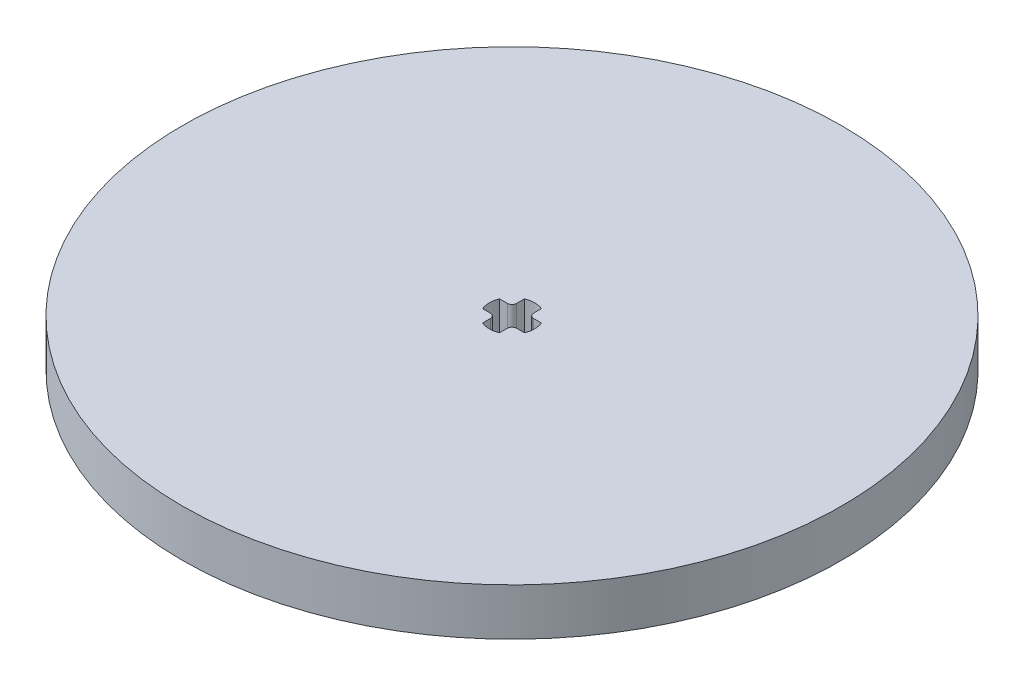
ISO-10303-21;
HEADER;
FILE_DESCRIPTION(('STEP AP214'),'2;1');
FILE_NAME('part.step','',(''),(''),'','','');
FILE_SCHEMA(('AUTOMOTIVE_DESIGN { 1 0 10303 214 1 1 1 1 }'));
ENDSEC;
DATA;
#1=APPLICATION_CONTEXT('core data for automotive mechanical design processes');
#2=APPLICATION_PROTOCOL_DEFINITION('international standard','automotive_design',2000,#1);
#3=PRODUCT_CONTEXT('',#1,'mechanical');
#4=PRODUCT('Part','Part','',(#3));
#5=PRODUCT_RELATED_PRODUCT_CATEGORY('part','',(#4));
#6=PRODUCT_DEFINITION_FORMATION('','',#4);
#7=PRODUCT_DEFINITION_CONTEXT('part definition',#1,'design');
#8=PRODUCT_DEFINITION('design','',#6,#7);
#9=PRODUCT_DEFINITION_SHAPE('','',#8);
#10=(LENGTH_UNIT() NAMED_UNIT(*) SI_UNIT(.MILLI.,.METRE.));
#11=(NAMED_UNIT(*) PLANE_ANGLE_UNIT() SI_UNIT($,.RADIAN.));
#12=(NAMED_UNIT(*) SI_UNIT($,.STERADIAN.) SOLID_ANGLE_UNIT());
#13=UNCERTAINTY_MEASURE_WITH_UNIT(LENGTH_MEASURE(1.E-05),#10,'distance_accuracy_value','');
#14=(GEOMETRIC_REPRESENTATION_CONTEXT(3) GLOBAL_UNCERTAINTY_ASSIGNED_CONTEXT((#13)) GLOBAL_UNIT_ASSIGNED_CONTEXT((#10,
#11,#12)) REPRESENTATION_CONTEXT('',''));
#15=CARTESIAN_POINT('',(0.,0.,0.));
#16=DIRECTION('',(0.,0.,1.));
#17=DIRECTION('',(1.,0.,0.));
#18=AXIS2_PLACEMENT_3D('',#15,#16,#17);
#19=CARTESIAN_POINT('',(0.,5.,0.));
#20=DIRECTION('',(0.,-1.,0.));
#21=DIRECTION('',(0.,0.,-1.));
#22=AXIS2_PLACEMENT_3D('',#19,#20,#21);
#23=CYLINDRICAL_SURFACE('',#22,2.4);
#24=CARTESIAN_POINT('',(0.,0.,0.));
#25=DIRECTION('',(0.,1.,0.));
#26=DIRECTION('',(0.,0.,1.));
#27=AXIS2_PLACEMENT_3D('',#24,#25,#26);
#28=CIRCLE('',#27,2.4);
#29=CARTESIAN_POINT('',(-0.9,0.,2.2248595461287));
#30=VERTEX_POINT('',#29);
#31=CARTESIAN_POINT('',(0.9,0.,2.2248595461287));
#32=VERTEX_POINT('',#31);
#33=EDGE_CURVE('E180',#30,#32,#28,.T.);
#34=ORIENTED_EDGE('',*,*,#33,.F.);
#35=DIRECTION('',(0.,-1.,0.));
#36=VECTOR('',#35,1.);
#37=CARTESIAN_POINT('',(-0.9,5.,2.2248595461287));
#38=LINE('',#37,#36);
#39=CARTESIAN_POINT('',(-0.9,5.,2.2248595461287));
#40=VERTEX_POINT('',#39);
#41=EDGE_CURVE('E11',#40,#30,#38,.T.);
#42=ORIENTED_EDGE('',*,*,#41,.F.);
#43=CARTESIAN_POINT('',(0.,5.,0.));
#44=DIRECTION('',(0.,1.,0.));
#45=DIRECTION('',(0.,0.,1.));
#46=AXIS2_PLACEMENT_3D('',#43,#44,#45);
#47=CIRCLE('',#46,2.4);
#48=CARTESIAN_POINT('',(0.9,5.,2.2248595461287));
#49=VERTEX_POINT('',#48);
#50=EDGE_CURVE('E227',#40,#49,#47,.T.);
#51=ORIENTED_EDGE('',*,*,#50,.T.);
#52=DIRECTION('',(0.,-1.,0.));
#53=VECTOR('',#52,1.);
#54=CARTESIAN_POINT('',(0.9,5.,2.2248595461287));
#55=LINE('',#54,#53);
#56=EDGE_CURVE('E50',#49,#32,#55,.T.);
#57=ORIENTED_EDGE('',*,*,#56,.T.);
#58=EDGE_LOOP('',(#34,#42,#51,#57));
#59=FACE_BOUND('',#58,.T.);
#60=ADVANCED_FACE('F34',(#59),#23,.F.);
#61=CARTESIAN_POINT('',(-0.9,5.,0.));
#62=DIRECTION('',(-1.,0.,0.));
#63=DIRECTION('',(0.,0.,1.));
#64=AXIS2_PLACEMENT_3D('',#61,#62,#63);
#65=PLANE('',#64);
#66=DIRECTION('',(0.,0.,-1.));
#67=VECTOR('',#66,1.);
#68=CARTESIAN_POINT('',(-0.9,0.,0.));
#69=LINE('',#68,#67);
#70=CARTESIAN_POINT('',(-0.9,0.,1.4));
#71=VERTEX_POINT('',#70);
#72=EDGE_CURVE('E182',#30,#71,#69,.T.);
#73=ORIENTED_EDGE('',*,*,#72,.T.);
#74=DIRECTION('',(0.,-1.,0.));
#75=VECTOR('',#74,1.);
#76=CARTESIAN_POINT('',(-0.9,5.,1.4));
#77=LINE('',#76,#75);
#78=CARTESIAN_POINT('',(-0.9,5.,1.4));
#79=VERTEX_POINT('',#78);
#80=EDGE_CURVE('E42',#79,#71,#77,.T.);
#81=ORIENTED_EDGE('',*,*,#80,.F.);
#82=DIRECTION('',(0.,0.,-1.));
#83=VECTOR('',#82,1.);
#84=CARTESIAN_POINT('',(-0.9,5.,0.));
#85=LINE('',#84,#83);
#86=EDGE_CURVE('E274',#40,#79,#85,.T.);
#87=ORIENTED_EDGE('',*,*,#86,.F.);
#88=ORIENTED_EDGE('',*,*,#41,.T.);
#89=EDGE_LOOP('',(#73,#81,#87,#88));
#90=FACE_BOUND('',#89,.T.);
#91=ADVANCED_FACE('F259',(#90),#65,.F.);
#92=CARTESIAN_POINT('',(-1.4,5.,1.4));
#93=DIRECTION('',(0.,-1.,0.));
#94=DIRECTION('',(0.,0.,-1.));
#95=AXIS2_PLACEMENT_3D('',#92,#93,#94);
#96=CYLINDRICAL_SURFACE('',#95,0.5);
#97=CARTESIAN_POINT('',(-1.4,0.,1.4));
#98=DIRECTION('',(0.,1.,0.));
#99=DIRECTION('',(0.,0.,1.));
#100=AXIS2_PLACEMENT_3D('',#97,#98,#99);
#101=CIRCLE('',#100,0.5);
#102=CARTESIAN_POINT('',(-1.4,0.,0.9));
#103=VERTEX_POINT('',#102);
#104=EDGE_CURVE('E185',#103,#71,#101,.F.);
#105=ORIENTED_EDGE('',*,*,#104,.F.);
#106=DIRECTION('',(0.,-1.,0.));
#107=VECTOR('',#106,1.);
#108=CARTESIAN_POINT('',(-1.4,5.,0.9));
#109=LINE('',#108,#107);
#110=CARTESIAN_POINT('',(-1.4,5.,0.9));
#111=VERTEX_POINT('',#110);
#112=EDGE_CURVE('E249',#111,#103,#109,.T.);
#113=ORIENTED_EDGE('',*,*,#112,.F.);
#114=CARTESIAN_POINT('',(-1.4,5.,1.4));
#115=DIRECTION('',(0.,1.,0.));
#116=DIRECTION('',(0.,0.,1.));
#117=AXIS2_PLACEMENT_3D('',#114,#115,#116);
#118=CIRCLE('',#117,0.5);
#119=EDGE_CURVE('E256',#111,#79,#118,.F.);
#120=ORIENTED_EDGE('',*,*,#119,.T.);
#121=ORIENTED_EDGE('',*,*,#80,.T.);
#122=EDGE_LOOP('',(#105,#113,#120,#121));
#123=FACE_BOUND('',#122,.T.);
#124=ADVANCED_FACE('F254',(#123),#96,.T.);
#125=CARTESIAN_POINT('',(0.,5.,0.9));
#126=DIRECTION('',(0.,0.,1.));
#127=DIRECTION('',(1.,0.,0.));
#128=AXIS2_PLACEMENT_3D('',#125,#126,#127);
#129=PLANE('',#128);
#130=DIRECTION('',(-1.,0.,0.));
#131=VECTOR('',#130,1.);
#132=CARTESIAN_POINT('',(0.,0.,0.9));
#133=LINE('',#132,#131);
#134=CARTESIAN_POINT('',(-2.2248595461287,0.,0.9));
#135=VERTEX_POINT('',#134);
#136=EDGE_CURVE('E188',#103,#135,#133,.T.);
#137=ORIENTED_EDGE('',*,*,#136,.T.);
#138=DIRECTION('',(0.,-1.,0.));
#139=VECTOR('',#138,1.);
#140=CARTESIAN_POINT('',(-2.2248595461287,5.,0.9));
#141=LINE('',#140,#139);
#142=CARTESIAN_POINT('',(-2.2248595461287,5.,0.9));
#143=VERTEX_POINT('',#142);
#144=EDGE_CURVE('E247',#143,#135,#141,.T.);
#145=ORIENTED_EDGE('',*,*,#144,.F.);
#146=DIRECTION('',(-1.,0.,0.));
#147=VECTOR('',#146,1.);
#148=CARTESIAN_POINT('',(0.,5.,0.9));
#149=LINE('',#148,#147);
#150=EDGE_CURVE('E270',#111,#143,#149,.T.);
#151=ORIENTED_EDGE('',*,*,#150,.F.);
#152=ORIENTED_EDGE('',*,*,#112,.T.);
#153=EDGE_LOOP('',(#137,#145,#151,#152));
#154=FACE_BOUND('',#153,.T.);
#155=ADVANCED_FACE('F267',(#154),#129,.F.);
#156=CARTESIAN_POINT('',(0.,5.,0.));
#157=DIRECTION('',(0.,-1.,0.));
#158=DIRECTION('',(0.,0.,-1.));
#159=AXIS2_PLACEMENT_3D('',#156,#157,#158);
#160=CYLINDRICAL_SURFACE('',#159,2.4);
#161=CARTESIAN_POINT('',(0.,0.,0.));
#162=DIRECTION('',(0.,1.,0.));
#163=DIRECTION('',(0.,0.,1.));
#164=AXIS2_PLACEMENT_3D('',#161,#162,#163);
#165=CIRCLE('',#164,2.4);
#166=CARTESIAN_POINT('',(-2.2248595461287,0.,-0.9));
#167=VERTEX_POINT('',#166);
#168=EDGE_CURVE('E191',#167,#135,#165,.T.);
#169=ORIENTED_EDGE('',*,*,#168,.F.);
#170=DIRECTION('',(0.,-1.,0.));
#171=VECTOR('',#170,1.);
#172=CARTESIAN_POINT('',(-2.2248595461287,5.,-0.9));
#173=LINE('',#172,#171);
#174=CARTESIAN_POINT('',(-2.2248595461287,5.,-0.9));
#175=VERTEX_POINT('',#174);
#176=EDGE_CURVE('E245',#175,#167,#173,.T.);
#177=ORIENTED_EDGE('',*,*,#176,.F.);
#178=CARTESIAN_POINT('',(0.,5.,0.));
#179=DIRECTION('',(0.,1.,0.));
#180=DIRECTION('',(0.,0.,1.));
#181=AXIS2_PLACEMENT_3D('',#178,#179,#180);
#182=CIRCLE('',#181,2.4);
#183=EDGE_CURVE('E272',#175,#143,#182,.T.);
#184=ORIENTED_EDGE('',*,*,#183,.T.);
#185=ORIENTED_EDGE('',*,*,#144,.T.);
#186=EDGE_LOOP('',(#169,#177,#184,#185));
#187=FACE_BOUND('',#186,.T.);
#188=ADVANCED_FACE('F325',(#187),#160,.F.);
#189=CARTESIAN_POINT('',(0.,5.,-0.9));
#190=DIRECTION('',(0.,0.,1.));
#191=DIRECTION('',(1.,0.,0.));
#192=AXIS2_PLACEMENT_3D('',#189,#190,#191);
#193=PLANE('',#192);
#194=DIRECTION('',(-1.,0.,0.));
#195=VECTOR('',#194,1.);
#196=CARTESIAN_POINT('',(0.,0.,-0.9));
#197=LINE('',#196,#195);
#198=CARTESIAN_POINT('',(-1.4,0.,-0.9));
#199=VERTEX_POINT('',#198);
#200=EDGE_CURVE('E194',#199,#167,#197,.T.);
#201=ORIENTED_EDGE('',*,*,#200,.F.);
#202=DIRECTION('',(0.,-1.,0.));
#203=VECTOR('',#202,1.);
#204=CARTESIAN_POINT('',(-1.4,5.,-0.9));
#205=LINE('',#204,#203);
#206=CARTESIAN_POINT('',(-1.4,5.,-0.9));
#207=VERTEX_POINT('',#206);
#208=EDGE_CURVE('E243',#207,#199,#205,.T.);
#209=ORIENTED_EDGE('',*,*,#208,.F.);
#210=DIRECTION('',(-1.,0.,0.));
#211=VECTOR('',#210,1.);
#212=CARTESIAN_POINT('',(0.,5.,-0.9));
#213=LINE('',#212,#211);
#214=EDGE_CURVE('E280',#207,#175,#213,.T.);
#215=ORIENTED_EDGE('',*,*,#214,.T.);
#216=ORIENTED_EDGE('',*,*,#176,.T.);
#217=EDGE_LOOP('',(#201,#209,#215,#216));
#218=FACE_BOUND('',#217,.T.);
#219=ADVANCED_FACE('F328',(#218),#193,.T.);
#220=CARTESIAN_POINT('',(-1.4,5.,-1.4));
#221=DIRECTION('',(0.,-1.,0.));
#222=DIRECTION('',(0.,0.,-1.));
#223=AXIS2_PLACEMENT_3D('',#220,#221,#222);
#224=CYLINDRICAL_SURFACE('',#223,0.5);
#225=CARTESIAN_POINT('',(-1.4,0.,-1.4));
#226=DIRECTION('',(0.,1.,0.));
#227=DIRECTION('',(0.,0.,1.));
#228=AXIS2_PLACEMENT_3D('',#225,#226,#227);
#229=CIRCLE('',#228,0.5);
#230=CARTESIAN_POINT('',(-0.9,0.,-1.4));
#231=VERTEX_POINT('',#230);
#232=EDGE_CURVE('E197',#231,#199,#229,.F.);
#233=ORIENTED_EDGE('',*,*,#232,.F.);
#234=DIRECTION('',(0.,-1.,0.));
#235=VECTOR('',#234,1.);
#236=CARTESIAN_POINT('',(-0.9,5.,-1.4));
#237=LINE('',#236,#235);
#238=CARTESIAN_POINT('',(-0.9,5.,-1.4));
#239=VERTEX_POINT('',#238);
#240=EDGE_CURVE('E241',#239,#231,#237,.T.);
#241=ORIENTED_EDGE('',*,*,#240,.F.);
#242=CARTESIAN_POINT('',(-1.4,5.,-1.4));
#243=DIRECTION('',(0.,1.,0.));
#244=DIRECTION('',(0.,0.,1.));
#245=AXIS2_PLACEMENT_3D('',#242,#243,#244);
#246=CIRCLE('',#245,0.5);
#247=EDGE_CURVE('E283',#239,#207,#246,.F.);
#248=ORIENTED_EDGE('',*,*,#247,.T.);
#249=ORIENTED_EDGE('',*,*,#208,.T.);
#250=EDGE_LOOP('',(#233,#241,#248,#249));
#251=FACE_BOUND('',#250,.T.);
#252=ADVANCED_FACE('F332',(#251),#224,.T.);
#253=CARTESIAN_POINT('',(-0.9,5.,0.));
#254=DIRECTION('',(-1.,0.,0.));
#255=DIRECTION('',(0.,0.,1.));
#256=AXIS2_PLACEMENT_3D('',#253,#254,#255);
#257=PLANE('',#256);
#258=DIRECTION('',(0.,0.,-1.));
#259=VECTOR('',#258,1.);
#260=CARTESIAN_POINT('',(-0.9,0.,0.));
#261=LINE('',#260,#259);
#262=CARTESIAN_POINT('',(-0.9,0.,-2.2248595461287));
#263=VERTEX_POINT('',#262);
#264=EDGE_CURVE('E200',#231,#263,#261,.T.);
#265=ORIENTED_EDGE('',*,*,#264,.T.);
#266=DIRECTION('',(0.,-1.,0.));
#267=VECTOR('',#266,1.);
#268=CARTESIAN_POINT('',(-0.9,5.,-2.2248595461287));
#269=LINE('',#268,#267);
#270=CARTESIAN_POINT('',(-0.9,5.,-2.2248595461287));
#271=VERTEX_POINT('',#270);
#272=EDGE_CURVE('E239',#271,#263,#269,.T.);
#273=ORIENTED_EDGE('',*,*,#272,.F.);
#274=DIRECTION('',(0.,0.,-1.));
#275=VECTOR('',#274,1.);
#276=CARTESIAN_POINT('',(-0.9,5.,0.));
#277=LINE('',#276,#275);
#278=EDGE_CURVE('E286',#239,#271,#277,.T.);
#279=ORIENTED_EDGE('',*,*,#278,.F.);
#280=ORIENTED_EDGE('',*,*,#240,.T.);
#281=EDGE_LOOP('',(#265,#273,#279,#280));
#282=FACE_BOUND('',#281,.T.);
#283=ADVANCED_FACE('F336',(#282),#257,.F.);
#284=CARTESIAN_POINT('',(0.,5.,0.));
#285=DIRECTION('',(0.,-1.,0.));
#286=DIRECTION('',(0.,0.,-1.));
#287=AXIS2_PLACEMENT_3D('',#284,#285,#286);
#288=CYLINDRICAL_SURFACE('',#287,2.4);
#289=CARTESIAN_POINT('',(0.,0.,0.));
#290=DIRECTION('',(0.,1.,0.));
#291=DIRECTION('',(0.,0.,1.));
#292=AXIS2_PLACEMENT_3D('',#289,#290,#291);
#293=CIRCLE('',#292,2.4);
#294=CARTESIAN_POINT('',(0.9,0.,-2.2248595461287));
#295=VERTEX_POINT('',#294);
#296=EDGE_CURVE('E203',#295,#263,#293,.T.);
#297=ORIENTED_EDGE('',*,*,#296,.F.);
#298=DIRECTION('',(0.,-1.,0.));
#299=VECTOR('',#298,1.);
#300=CARTESIAN_POINT('',(0.9,5.,-2.2248595461287));
#301=LINE('',#300,#299);
#302=CARTESIAN_POINT('',(0.9,5.,-2.2248595461287));
#303=VERTEX_POINT('',#302);
#304=EDGE_CURVE('E237',#303,#295,#301,.T.);
#305=ORIENTED_EDGE('',*,*,#304,.F.);
#306=CARTESIAN_POINT('',(0.,5.,0.));
#307=DIRECTION('',(0.,1.,0.));
#308=DIRECTION('',(0.,0.,1.));
#309=AXIS2_PLACEMENT_3D('',#306,#307,#308);
#310=CIRCLE('',#309,2.4);
#311=EDGE_CURVE('E288',#303,#271,#310,.T.);
#312=ORIENTED_EDGE('',*,*,#311,.T.);
#313=ORIENTED_EDGE('',*,*,#272,.T.);
#314=EDGE_LOOP('',(#297,#305,#312,#313));
#315=FACE_BOUND('',#314,.T.);
#316=ADVANCED_FACE('F340',(#315),#288,.F.);
#317=CARTESIAN_POINT('',(0.9,5.,0.));
#318=DIRECTION('',(-1.,0.,0.));
#319=DIRECTION('',(0.,0.,1.));
#320=AXIS2_PLACEMENT_3D('',#317,#318,#319);
#321=PLANE('',#320);
#322=DIRECTION('',(0.,0.,-1.));
#323=VECTOR('',#322,1.);
#324=CARTESIAN_POINT('',(0.9,0.,0.));
#325=LINE('',#324,#323);
#326=CARTESIAN_POINT('',(0.9,0.,-1.4));
#327=VERTEX_POINT('',#326);
#328=EDGE_CURVE('E206',#327,#295,#325,.T.);
#329=ORIENTED_EDGE('',*,*,#328,.F.);
#330=DIRECTION('',(0.,-1.,0.));
#331=VECTOR('',#330,1.);
#332=CARTESIAN_POINT('',(0.9,5.,-1.4));
#333=LINE('',#332,#331);
#334=CARTESIAN_POINT('',(0.9,5.,-1.4));
#335=VERTEX_POINT('',#334);
#336=EDGE_CURVE('E235',#335,#327,#333,.T.);
#337=ORIENTED_EDGE('',*,*,#336,.F.);
#338=DIRECTION('',(0.,0.,-1.));
#339=VECTOR('',#338,1.);
#340=CARTESIAN_POINT('',(0.9,5.,0.));
#341=LINE('',#340,#339);
#342=EDGE_CURVE('E291',#335,#303,#341,.T.);
#343=ORIENTED_EDGE('',*,*,#342,.T.);
#344=ORIENTED_EDGE('',*,*,#304,.T.);
#345=EDGE_LOOP('',(#329,#337,#343,#344));
#346=FACE_BOUND('',#345,.T.);
#347=ADVANCED_FACE('F344',(#346),#321,.T.);
#348=CARTESIAN_POINT('',(1.4,5.,-1.4));
#349=DIRECTION('',(0.,-1.,0.));
#350=DIRECTION('',(0.,0.,-1.));
#351=AXIS2_PLACEMENT_3D('',#348,#349,#350);
#352=CYLINDRICAL_SURFACE('',#351,0.5);
#353=CARTESIAN_POINT('',(1.4,0.,-1.4));
#354=DIRECTION('',(0.,1.,0.));
#355=DIRECTION('',(0.,0.,1.));
#356=AXIS2_PLACEMENT_3D('',#353,#354,#355);
#357=CIRCLE('',#356,0.5);
#358=CARTESIAN_POINT('',(1.4,0.,-0.9));
#359=VERTEX_POINT('',#358);
#360=EDGE_CURVE('E209',#359,#327,#357,.F.);
#361=ORIENTED_EDGE('',*,*,#360,.F.);
#362=DIRECTION('',(0.,-1.,0.));
#363=VECTOR('',#362,1.);
#364=CARTESIAN_POINT('',(1.4,5.,-0.9));
#365=LINE('',#364,#363);
#366=CARTESIAN_POINT('',(1.4,5.,-0.9));
#367=VERTEX_POINT('',#366);
#368=EDGE_CURVE('E233',#367,#359,#365,.T.);
#369=ORIENTED_EDGE('',*,*,#368,.F.);
#370=CARTESIAN_POINT('',(1.4,5.,-1.4));
#371=DIRECTION('',(0.,1.,0.));
#372=DIRECTION('',(0.,0.,1.));
#373=AXIS2_PLACEMENT_3D('',#370,#371,#372);
#374=CIRCLE('',#373,0.5);
#375=EDGE_CURVE('E294',#367,#335,#374,.F.);
#376=ORIENTED_EDGE('',*,*,#375,.T.);
#377=ORIENTED_EDGE('',*,*,#336,.T.);
#378=EDGE_LOOP('',(#361,#369,#376,#377));
#379=FACE_BOUND('',#378,.T.);
#380=ADVANCED_FACE('F348',(#379),#352,.T.);
#381=CARTESIAN_POINT('',(0.,5.,-0.9));
#382=DIRECTION('',(0.,0.,1.));
#383=DIRECTION('',(1.,0.,0.));
#384=AXIS2_PLACEMENT_3D('',#381,#382,#383);
#385=PLANE('',#384);
#386=DIRECTION('',(-1.,0.,0.));
#387=VECTOR('',#386,1.);
#388=CARTESIAN_POINT('',(0.,0.,-0.9));
#389=LINE('',#388,#387);
#390=CARTESIAN_POINT('',(2.2248595461287,0.,-0.9));
#391=VERTEX_POINT('',#390);
#392=EDGE_CURVE('E212',#391,#359,#389,.T.);
#393=ORIENTED_EDGE('',*,*,#392,.F.);
#394=DIRECTION('',(0.,-1.,0.));
#395=VECTOR('',#394,1.);
#396=CARTESIAN_POINT('',(2.2248595461287,5.,-0.9));
#397=LINE('',#396,#395);
#398=CARTESIAN_POINT('',(2.2248595461287,5.,-0.9));
#399=VERTEX_POINT('',#398);
#400=EDGE_CURVE('E231',#399,#391,#397,.T.);
#401=ORIENTED_EDGE('',*,*,#400,.F.);
#402=DIRECTION('',(-1.,0.,0.));
#403=VECTOR('',#402,1.);
#404=CARTESIAN_POINT('',(0.,5.,-0.9));
#405=LINE('',#404,#403);
#406=EDGE_CURVE('E297',#399,#367,#405,.T.);
#407=ORIENTED_EDGE('',*,*,#406,.T.);
#408=ORIENTED_EDGE('',*,*,#368,.T.);
#409=EDGE_LOOP('',(#393,#401,#407,#408));
#410=FACE_BOUND('',#409,.T.);
#411=ADVANCED_FACE('F352',(#410),#385,.T.);
#412=CARTESIAN_POINT('',(0.,5.,0.));
#413=DIRECTION('',(0.,-1.,0.));
#414=DIRECTION('',(0.,0.,-1.));
#415=AXIS2_PLACEMENT_3D('',#412,#413,#414);
#416=CYLINDRICAL_SURFACE('',#415,2.4);
#417=CARTESIAN_POINT('',(0.,0.,0.));
#418=DIRECTION('',(0.,1.,0.));
#419=DIRECTION('',(0.,0.,1.));
#420=AXIS2_PLACEMENT_3D('',#417,#418,#419);
#421=CIRCLE('',#420,2.4);
#422=CARTESIAN_POINT('',(2.2248595461287,0.,0.9));
#423=VERTEX_POINT('',#422);
#424=EDGE_CURVE('E215',#423,#391,#421,.T.);
#425=ORIENTED_EDGE('',*,*,#424,.F.);
#426=DIRECTION('',(0.,-1.,0.));
#427=VECTOR('',#426,1.);
#428=CARTESIAN_POINT('',(2.2248595461287,5.,0.9));
#429=LINE('',#428,#427);
#430=CARTESIAN_POINT('',(2.2248595461287,5.,0.9));
#431=VERTEX_POINT('',#430);
#432=EDGE_CURVE('E169',#431,#423,#429,.T.);
#433=ORIENTED_EDGE('',*,*,#432,.F.);
#434=CARTESIAN_POINT('',(0.,5.,0.));
#435=DIRECTION('',(0.,1.,0.));
#436=DIRECTION('',(0.,0.,1.));
#437=AXIS2_PLACEMENT_3D('',#434,#435,#436);
#438=CIRCLE('',#437,2.4);
#439=EDGE_CURVE('E159',#431,#399,#438,.T.);
#440=ORIENTED_EDGE('',*,*,#439,.T.);
#441=ORIENTED_EDGE('',*,*,#400,.T.);
#442=EDGE_LOOP('',(#425,#433,#440,#441));
#443=FACE_BOUND('',#442,.T.);
#444=ADVANCED_FACE('F301',(#443),#416,.F.);
#445=CARTESIAN_POINT('',(0.,5.,0.9));
#446=DIRECTION('',(0.,0.,1.));
#447=DIRECTION('',(1.,0.,0.));
#448=AXIS2_PLACEMENT_3D('',#445,#446,#447);
#449=PLANE('',#448);
#450=DIRECTION('',(-1.,0.,0.));
#451=VECTOR('',#450,1.);
#452=CARTESIAN_POINT('',(0.,0.,0.9));
#453=LINE('',#452,#451);
#454=CARTESIAN_POINT('',(1.4,0.,0.9));
#455=VERTEX_POINT('',#454);
#456=EDGE_CURVE('E166',#423,#455,#453,.T.);
#457=ORIENTED_EDGE('',*,*,#456,.T.);
#458=DIRECTION('',(0.,-1.,0.));
#459=VECTOR('',#458,1.);
#460=CARTESIAN_POINT('',(1.4,5.,0.9));
#461=LINE('',#460,#459);
#462=CARTESIAN_POINT('',(1.4,5.,0.9));
#463=VERTEX_POINT('',#462);
#464=EDGE_CURVE('E163',#463,#455,#461,.T.);
#465=ORIENTED_EDGE('',*,*,#464,.F.);
#466=DIRECTION('',(-1.,0.,0.));
#467=VECTOR('',#466,1.);
#468=CARTESIAN_POINT('',(0.,5.,0.9));
#469=LINE('',#468,#467);
#470=EDGE_CURVE('E149',#431,#463,#469,.T.);
#471=ORIENTED_EDGE('',*,*,#470,.F.);
#472=ORIENTED_EDGE('',*,*,#432,.T.);
#473=EDGE_LOOP('',(#457,#465,#471,#472));
#474=FACE_BOUND('',#473,.T.);
#475=ADVANCED_FACE('F164',(#474),#449,.F.);
#476=CARTESIAN_POINT('',(1.4,5.,1.4));
#477=DIRECTION('',(0.,-1.,0.));
#478=DIRECTION('',(0.,0.,-1.));
#479=AXIS2_PLACEMENT_3D('',#476,#477,#478);
#480=CYLINDRICAL_SURFACE('',#479,0.5);
#481=CARTESIAN_POINT('',(1.4,0.,1.4));
#482=DIRECTION('',(0.,1.,0.));
#483=DIRECTION('',(0.,0.,1.));
#484=AXIS2_PLACEMENT_3D('',#481,#482,#483);
#485=CIRCLE('',#484,0.5);
#486=CARTESIAN_POINT('',(0.9,0.,1.4));
#487=VERTEX_POINT('',#486);
#488=EDGE_CURVE('E219',#487,#455,#485,.F.);
#489=ORIENTED_EDGE('',*,*,#488,.F.);
#490=DIRECTION('',(0.,-1.,0.));
#491=VECTOR('',#490,1.);
#492=CARTESIAN_POINT('',(0.9,5.,1.4));
#493=LINE('',#492,#491);
#494=CARTESIAN_POINT('',(0.9,5.,1.4));
#495=VERTEX_POINT('',#494);
#496=EDGE_CURVE('E99',#495,#487,#493,.T.);
#497=ORIENTED_EDGE('',*,*,#496,.F.);
#498=CARTESIAN_POINT('',(1.4,5.,1.4));
#499=DIRECTION('',(0.,1.,0.));
#500=DIRECTION('',(0.,0.,1.));
#501=AXIS2_PLACEMENT_3D('',#498,#499,#500);
#502=CIRCLE('',#501,0.5);
#503=EDGE_CURVE('E156',#495,#463,#502,.F.);
#504=ORIENTED_EDGE('',*,*,#503,.T.);
#505=ORIENTED_EDGE('',*,*,#464,.T.);
#506=EDGE_LOOP('',(#489,#497,#504,#505));
#507=FACE_BOUND('',#506,.T.);
#508=ADVANCED_FACE('F171',(#507),#480,.T.);
#509=CARTESIAN_POINT('',(0.9,5.,0.));
#510=DIRECTION('',(-1.,0.,0.));
#511=DIRECTION('',(0.,0.,1.));
#512=AXIS2_PLACEMENT_3D('',#509,#510,#511);
#513=PLANE('',#512);
#514=DIRECTION('',(0.,0.,-1.));
#515=VECTOR('',#514,1.);
#516=CARTESIAN_POINT('',(0.9,0.,0.));
#517=LINE('',#516,#515);
#518=EDGE_CURVE('E221',#32,#487,#517,.T.);
#519=ORIENTED_EDGE('',*,*,#518,.F.);
#520=ORIENTED_EDGE('',*,*,#56,.F.);
#521=DIRECTION('',(0.,0.,-1.));
#522=VECTOR('',#521,1.);
#523=CARTESIAN_POINT('',(0.9,5.,0.));
#524=LINE('',#523,#522);
#525=EDGE_CURVE('E172',#49,#495,#524,.T.);
#526=ORIENTED_EDGE('',*,*,#525,.T.);
#527=ORIENTED_EDGE('',*,*,#496,.T.);
#528=EDGE_LOOP('',(#519,#520,#526,#527));
#529=FACE_BOUND('',#528,.T.);
#530=ADVANCED_FACE('F303',(#529),#513,.T.);
#531=CARTESIAN_POINT('',(0.,5.,0.));
#532=DIRECTION('',(0.,-1.,0.));
#533=DIRECTION('',(0.,0.,-1.));
#534=AXIS2_PLACEMENT_3D('',#531,#532,#533);
#535=CYLINDRICAL_SURFACE('',#534,35.);
#536=CARTESIAN_POINT('',(0.,5.,0.));
#537=DIRECTION('',(0.,1.,0.));
#538=DIRECTION('',(0.,0.,1.));
#539=AXIS2_PLACEMENT_3D('',#536,#537,#538);
#540=CIRCLE('',#539,35.);
#541=CARTESIAN_POINT('',(0.,5.,35.));
#542=VERTEX_POINT('',#541);
#543=EDGE_CURVE('E174',#542,#542,#540,.T.);
#544=ORIENTED_EDGE('',*,*,#543,.F.);
#545=EDGE_LOOP('',(#544));
#546=FACE_BOUND('',#545,.T.);
#547=CARTESIAN_POINT('',(0.,0.,0.));
#548=DIRECTION('',(0.,1.,0.));
#549=DIRECTION('',(0.,0.,1.));
#550=AXIS2_PLACEMENT_3D('',#547,#548,#549);
#551=CIRCLE('',#550,35.);
#552=CARTESIAN_POINT('',(0.,0.,35.));
#553=VERTEX_POINT('',#552);
#554=EDGE_CURVE('E224',#553,#553,#551,.T.);
#555=ORIENTED_EDGE('',*,*,#554,.T.);
#556=EDGE_LOOP('',(#555));
#557=FACE_BOUND('',#556,.T.);
#558=ADVANCED_FACE('F305',(#546,#557),#535,.T.);
#559=CARTESIAN_POINT('',(0.,5.,0.));
#560=DIRECTION('',(0.,1.,0.));
#561=DIRECTION('',(0.,0.,1.));
#562=AXIS2_PLACEMENT_3D('',#559,#560,#561);
#563=PLANE('',#562);
#564=ORIENTED_EDGE('',*,*,#50,.F.);
#565=ORIENTED_EDGE('',*,*,#86,.T.);
#566=ORIENTED_EDGE('',*,*,#119,.F.);
#567=ORIENTED_EDGE('',*,*,#150,.T.);
#568=ORIENTED_EDGE('',*,*,#183,.F.);
#569=ORIENTED_EDGE('',*,*,#214,.F.);
#570=ORIENTED_EDGE('',*,*,#247,.F.);
#571=ORIENTED_EDGE('',*,*,#278,.T.);
#572=ORIENTED_EDGE('',*,*,#311,.F.);
#573=ORIENTED_EDGE('',*,*,#342,.F.);
#574=ORIENTED_EDGE('',*,*,#375,.F.);
#575=ORIENTED_EDGE('',*,*,#406,.F.);
#576=ORIENTED_EDGE('',*,*,#439,.F.);
#577=ORIENTED_EDGE('',*,*,#470,.T.);
#578=ORIENTED_EDGE('',*,*,#503,.F.);
#579=ORIENTED_EDGE('',*,*,#525,.F.);
#580=EDGE_LOOP('',(#564,#565,#566,#567,#568,#569,#570,#571,#572,#573,#574,#575,#576,#577,#578,#579));
#581=FACE_BOUND('',#580,.T.);
#582=ORIENTED_EDGE('',*,*,#543,.T.);
#583=EDGE_LOOP('',(#582));
#584=FACE_BOUND('',#583,.T.);
#585=ADVANCED_FACE('F152',(#581,#584),#563,.T.);
#586=CARTESIAN_POINT('',(0.,0.,0.));
#587=DIRECTION('',(0.,1.,0.));
#588=DIRECTION('',(0.,0.,1.));
#589=AXIS2_PLACEMENT_3D('',#586,#587,#588);
#590=PLANE('',#589);
#591=ORIENTED_EDGE('',*,*,#33,.T.);
#592=ORIENTED_EDGE('',*,*,#518,.T.);
#593=ORIENTED_EDGE('',*,*,#488,.T.);
#594=ORIENTED_EDGE('',*,*,#456,.F.);
#595=ORIENTED_EDGE('',*,*,#424,.T.);
#596=ORIENTED_EDGE('',*,*,#392,.T.);
#597=ORIENTED_EDGE('',*,*,#360,.T.);
#598=ORIENTED_EDGE('',*,*,#328,.T.);
#599=ORIENTED_EDGE('',*,*,#296,.T.);
#600=ORIENTED_EDGE('',*,*,#264,.F.);
#601=ORIENTED_EDGE('',*,*,#232,.T.);
#602=ORIENTED_EDGE('',*,*,#200,.T.);
#603=ORIENTED_EDGE('',*,*,#168,.T.);
#604=ORIENTED_EDGE('',*,*,#136,.F.);
#605=ORIENTED_EDGE('',*,*,#104,.T.);
#606=ORIENTED_EDGE('',*,*,#72,.F.);
#607=EDGE_LOOP('',(#591,#592,#593,#594,#595,#596,#597,#598,#599,#600,#601,#602,#603,#604,#605,#606));
#608=FACE_BOUND('',#607,.T.);
#609=ORIENTED_EDGE('',*,*,#554,.F.);
#610=EDGE_LOOP('',(#609));
#611=FACE_BOUND('',#610,.T.);
#612=ADVANCED_FACE('F262',(#608,#611),#590,.F.);
#613=CLOSED_SHELL('',(#60,#91,#124,#155,#188,#219,#252,#283,#316,#347,#380,#411,#444,#475,#508,
#530,#558,#585,#612));
#614=MANIFOLD_SOLID_BREP('B2',#613);
#615=ADVANCED_BREP_SHAPE_REPRESENTATION('',(#18,#614),#14);
#616=SHAPE_DEFINITION_REPRESENTATION(#9,#615);
ENDSEC;
END-ISO-10303-21;
